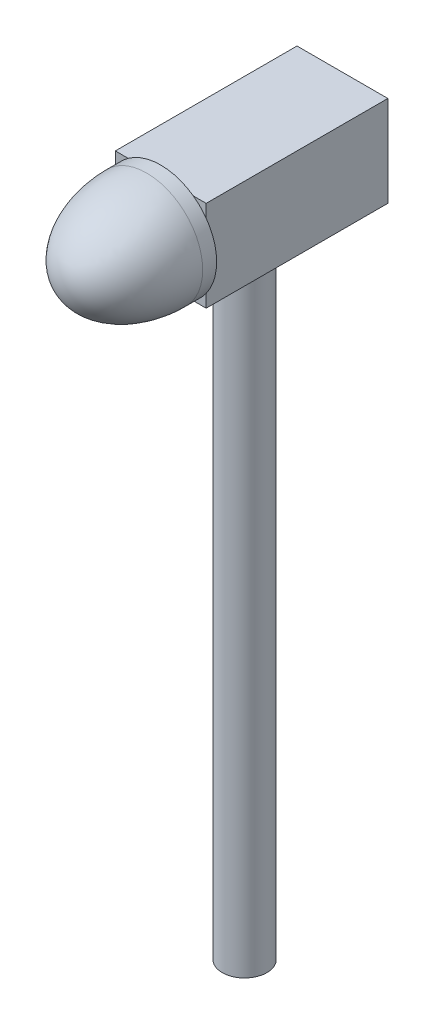
ISO-10303-21;
HEADER;
FILE_DESCRIPTION(('STEP AP214'),'2;1');
FILE_NAME('part.step','',(''),(''),'','','');
FILE_SCHEMA(('AUTOMOTIVE_DESIGN { 1 0 10303 214 1 1 1 1 }'));
ENDSEC;
DATA;
#1=APPLICATION_CONTEXT('core data for automotive mechanical design processes');
#2=APPLICATION_PROTOCOL_DEFINITION('international standard','automotive_design',2000,#1);
#3=PRODUCT_CONTEXT('',#1,'mechanical');
#4=PRODUCT('Part','Part','',(#3));
#5=PRODUCT_RELATED_PRODUCT_CATEGORY('part','',(#4));
#6=PRODUCT_DEFINITION_FORMATION('','',#4);
#7=PRODUCT_DEFINITION_CONTEXT('part definition',#1,'design');
#8=PRODUCT_DEFINITION('design','',#6,#7);
#9=PRODUCT_DEFINITION_SHAPE('','',#8);
#10=(LENGTH_UNIT() NAMED_UNIT(*) SI_UNIT(.MILLI.,.METRE.));
#11=(NAMED_UNIT(*) PLANE_ANGLE_UNIT() SI_UNIT($,.RADIAN.));
#12=(NAMED_UNIT(*) SI_UNIT($,.STERADIAN.) SOLID_ANGLE_UNIT());
#13=UNCERTAINTY_MEASURE_WITH_UNIT(LENGTH_MEASURE(1.E-05),#10,'distance_accuracy_value','');
#14=(GEOMETRIC_REPRESENTATION_CONTEXT(3) GLOBAL_UNCERTAINTY_ASSIGNED_CONTEXT((#13)) GLOBAL_UNIT_ASSIGNED_CONTEXT((#10,
#11,#12)) REPRESENTATION_CONTEXT('',''));
#15=CARTESIAN_POINT('',(0.,0.,0.));
#16=DIRECTION('',(0.,0.,1.));
#17=DIRECTION('',(1.,0.,0.));
#18=AXIS2_PLACEMENT_3D('',#15,#16,#17);
#19=CARTESIAN_POINT('',(-32.5,515.,60.));
#20=DIRECTION('',(0.,0.,-1.));
#21=DIRECTION('',(-1.,0.,0.));
#22=AXIS2_PLACEMENT_3D('',#19,#20,#21);
#23=PLANE('',#22);
#24=CARTESIAN_POINT('',(0.,482.5,60.));
#25=DIRECTION('',(0.,0.,1.));
#26=DIRECTION('',(1.,0.,0.));
#27=AXIS2_PLACEMENT_3D('',#24,#25,#26);
#28=CIRCLE('',#27,40.);
#29=CARTESIAN_POINT('',(32.5,505.818447632722,60.));
#30=VERTEX_POINT('',#29);
#31=CARTESIAN_POINT('',(23.3184476327221,515.,60.));
#32=VERTEX_POINT('',#31);
#33=EDGE_CURVE('E139',#30,#32,#28,.T.);
#34=ORIENTED_EDGE('',*,*,#33,.F.);
#35=DIRECTION('',(0.,-1.,0.));
#36=VECTOR('',#35,1.);
#37=CARTESIAN_POINT('',(32.5,515.,60.));
#38=LINE('',#37,#36);
#39=CARTESIAN_POINT('',(32.5,515.,60.));
#40=VERTEX_POINT('',#39);
#41=EDGE_CURVE('E121',#40,#30,#38,.T.);
#42=ORIENTED_EDGE('',*,*,#41,.F.);
#43=DIRECTION('',(1.,0.,0.));
#44=VECTOR('',#43,1.);
#45=CARTESIAN_POINT('',(-32.5,515.,60.));
#46=LINE('',#45,#44);
#47=EDGE_CURVE('E330',#32,#40,#46,.T.);
#48=ORIENTED_EDGE('',*,*,#47,.F.);
#49=EDGE_LOOP('',(#34,#42,#48));
#50=FACE_BOUND('',#49,.T.);
#51=ADVANCED_FACE('F45',(#50),#23,.F.);
#52=CARTESIAN_POINT('',(-23.3184476327221,515.,60.));
#53=VERTEX_POINT('',#52);
#54=CARTESIAN_POINT('',(-32.5,505.818447632722,60.));
#55=VERTEX_POINT('',#54);
#56=EDGE_CURVE('E12',#53,#55,#28,.T.);
#57=ORIENTED_EDGE('',*,*,#56,.F.);
#58=CARTESIAN_POINT('',(-32.5,515.,60.));
#59=VERTEX_POINT('',#58);
#60=EDGE_CURVE('E133',#59,#53,#46,.T.);
#61=ORIENTED_EDGE('',*,*,#60,.F.);
#62=DIRECTION('',(0.,-1.,0.));
#63=VECTOR('',#62,1.);
#64=CARTESIAN_POINT('',(-32.5,515.,60.));
#65=LINE('',#64,#63);
#66=EDGE_CURVE('E163',#59,#55,#65,.T.);
#67=ORIENTED_EDGE('',*,*,#66,.T.);
#68=EDGE_LOOP('',(#57,#61,#67));
#69=FACE_BOUND('',#68,.T.);
#70=ADVANCED_FACE('F191',(#69),#23,.F.);
#71=CARTESIAN_POINT('',(-32.5,459.181552367278,60.));
#72=VERTEX_POINT('',#71);
#73=CARTESIAN_POINT('',(-23.318447632722,450.,60.));
#74=VERTEX_POINT('',#73);
#75=EDGE_CURVE('E54',#72,#74,#28,.T.);
#76=ORIENTED_EDGE('',*,*,#75,.F.);
#77=CARTESIAN_POINT('',(-32.5,450.,60.));
#78=VERTEX_POINT('',#77);
#79=EDGE_CURVE('E164',#72,#78,#65,.T.);
#80=ORIENTED_EDGE('',*,*,#79,.T.);
#81=DIRECTION('',(1.,0.,0.));
#82=VECTOR('',#81,1.);
#83=CARTESIAN_POINT('',(-32.5,450.,60.));
#84=LINE('',#83,#82);
#85=EDGE_CURVE('E342',#78,#74,#84,.T.);
#86=ORIENTED_EDGE('',*,*,#85,.T.);
#87=EDGE_LOOP('',(#76,#80,#86));
#88=FACE_BOUND('',#87,.T.);
#89=ADVANCED_FACE('F188',(#88),#23,.F.);
#90=CARTESIAN_POINT('',(0.,450.,0.));
#91=DIRECTION('',(0.,-1.,0.));
#92=DIRECTION('',(0.,0.,-1.));
#93=AXIS2_PLACEMENT_3D('',#90,#91,#92);
#94=CYLINDRICAL_SURFACE('',#93,16.);
#95=CARTESIAN_POINT('',(0.,450.,0.));
#96=DIRECTION('',(0.,1.,0.));
#97=DIRECTION('',(0.,0.,1.));
#98=AXIS2_PLACEMENT_3D('',#95,#96,#97);
#99=CIRCLE('',#98,16.);
#100=CARTESIAN_POINT('',(0.,450.,16.));
#101=VERTEX_POINT('',#100);
#102=EDGE_CURVE('E143',#101,#101,#99,.T.);
#103=ORIENTED_EDGE('',*,*,#102,.F.);
#104=EDGE_LOOP('',(#103));
#105=FACE_BOUND('',#104,.T.);
#106=CARTESIAN_POINT('',(0.,0.,0.));
#107=DIRECTION('',(0.,1.,0.));
#108=DIRECTION('',(0.,0.,1.));
#109=AXIS2_PLACEMENT_3D('',#106,#107,#108);
#110=CIRCLE('',#109,16.);
#111=CARTESIAN_POINT('',(0.,0.,16.));
#112=VERTEX_POINT('',#111);
#113=EDGE_CURVE('E145',#112,#112,#110,.T.);
#114=ORIENTED_EDGE('',*,*,#113,.T.);
#115=EDGE_LOOP('',(#114));
#116=FACE_BOUND('',#115,.T.);
#117=ADVANCED_FACE('F177',(#105,#116),#94,.T.);
#118=CARTESIAN_POINT('',(0.,0.,0.));
#119=DIRECTION('',(0.,1.,0.));
#120=DIRECTION('',(0.,0.,1.));
#121=AXIS2_PLACEMENT_3D('',#118,#119,#120);
#122=PLANE('',#121);
#123=ORIENTED_EDGE('',*,*,#113,.F.);
#124=EDGE_LOOP('',(#123));
#125=FACE_BOUND('',#124,.T.);
#126=ADVANCED_FACE('F179',(#125),#122,.F.);
#127=CARTESIAN_POINT('',(32.5,515.,60.));
#128=DIRECTION('',(-1.,0.,0.));
#129=DIRECTION('',(0.,0.,1.));
#130=AXIS2_PLACEMENT_3D('',#127,#128,#129);
#131=PLANE('',#130);
#132=DIRECTION('',(0.,0.,-1.));
#133=VECTOR('',#132,1.);
#134=CARTESIAN_POINT('',(32.5,450.,60.));
#135=LINE('',#134,#133);
#136=CARTESIAN_POINT('',(32.5,450.,60.));
#137=VERTEX_POINT('',#136);
#138=CARTESIAN_POINT('',(32.5,450.,-70.));
#139=VERTEX_POINT('',#138);
#140=EDGE_CURVE('E151',#137,#139,#135,.T.);
#141=ORIENTED_EDGE('',*,*,#140,.T.);
#142=DIRECTION('',(0.,-1.,0.));
#143=VECTOR('',#142,1.);
#144=CARTESIAN_POINT('',(32.5,515.,-70.));
#145=LINE('',#144,#143);
#146=CARTESIAN_POINT('',(32.5,515.,-70.));
#147=VERTEX_POINT('',#146);
#148=EDGE_CURVE('E171',#147,#139,#145,.T.);
#149=ORIENTED_EDGE('',*,*,#148,.F.);
#150=DIRECTION('',(0.,0.,-1.));
#151=VECTOR('',#150,1.);
#152=CARTESIAN_POINT('',(32.5,515.,60.));
#153=LINE('',#152,#151);
#154=EDGE_CURVE('E343',#40,#147,#153,.T.);
#155=ORIENTED_EDGE('',*,*,#154,.F.);
#156=ORIENTED_EDGE('',*,*,#41,.T.);
#157=CARTESIAN_POINT('',(32.5,459.181552367278,60.));
#158=VERTEX_POINT('',#157);
#159=EDGE_CURVE('E113',#30,#158,#38,.T.);
#160=ORIENTED_EDGE('',*,*,#159,.T.);
#161=EDGE_CURVE('E117',#158,#137,#38,.T.);
#162=ORIENTED_EDGE('',*,*,#161,.T.);
#163=EDGE_LOOP('',(#141,#149,#155,#156,#160,#162));
#164=FACE_BOUND('',#163,.T.);
#165=ADVANCED_FACE('F116',(#164),#131,.F.);
#166=CARTESIAN_POINT('',(-32.5,515.,-70.));
#167=DIRECTION('',(0.,0.,1.));
#168=DIRECTION('',(1.,0.,0.));
#169=AXIS2_PLACEMENT_3D('',#166,#167,#168);
#170=PLANE('',#169);
#171=DIRECTION('',(-1.,0.,0.));
#172=VECTOR('',#171,1.);
#173=CARTESIAN_POINT('',(-32.5,450.,-70.));
#174=LINE('',#173,#172);
#175=CARTESIAN_POINT('',(-32.5,450.,-70.));
#176=VERTEX_POINT('',#175);
#177=EDGE_CURVE('E338',#139,#176,#174,.T.);
#178=ORIENTED_EDGE('',*,*,#177,.T.);
#179=DIRECTION('',(0.,-1.,0.));
#180=VECTOR('',#179,1.);
#181=CARTESIAN_POINT('',(-32.5,515.,-70.));
#182=LINE('',#181,#180);
#183=CARTESIAN_POINT('',(-32.5,515.,-70.));
#184=VERTEX_POINT('',#183);
#185=EDGE_CURVE('E166',#184,#176,#182,.T.);
#186=ORIENTED_EDGE('',*,*,#185,.F.);
#187=DIRECTION('',(-1.,0.,0.));
#188=VECTOR('',#187,1.);
#189=CARTESIAN_POINT('',(-32.5,515.,-70.));
#190=LINE('',#189,#188);
#191=EDGE_CURVE('E348',#147,#184,#190,.T.);
#192=ORIENTED_EDGE('',*,*,#191,.F.);
#193=ORIENTED_EDGE('',*,*,#148,.T.);
#194=EDGE_LOOP('',(#178,#186,#192,#193));
#195=FACE_BOUND('',#194,.T.);
#196=ADVANCED_FACE('F186',(#195),#170,.F.);
#197=CARTESIAN_POINT('',(-32.5,515.,60.));
#198=DIRECTION('',(1.,0.,0.));
#199=DIRECTION('',(0.,0.,-1.));
#200=AXIS2_PLACEMENT_3D('',#197,#198,#199);
#201=PLANE('',#200);
#202=DIRECTION('',(0.,0.,1.));
#203=VECTOR('',#202,1.);
#204=CARTESIAN_POINT('',(-32.5,450.,60.));
#205=LINE('',#204,#203);
#206=EDGE_CURVE('E340',#176,#78,#205,.T.);
#207=ORIENTED_EDGE('',*,*,#206,.T.);
#208=ORIENTED_EDGE('',*,*,#79,.F.);
#209=EDGE_CURVE('E159',#55,#72,#65,.T.);
#210=ORIENTED_EDGE('',*,*,#209,.F.);
#211=ORIENTED_EDGE('',*,*,#66,.F.);
#212=DIRECTION('',(0.,0.,1.));
#213=VECTOR('',#212,1.);
#214=CARTESIAN_POINT('',(-32.5,515.,60.));
#215=LINE('',#214,#213);
#216=EDGE_CURVE('E332',#184,#59,#215,.T.);
#217=ORIENTED_EDGE('',*,*,#216,.F.);
#218=ORIENTED_EDGE('',*,*,#185,.T.);
#219=EDGE_LOOP('',(#207,#208,#210,#211,#217,#218));
#220=FACE_BOUND('',#219,.T.);
#221=ADVANCED_FACE('F202',(#220),#201,.F.);
#222=CARTESIAN_POINT('',(23.318447632722,450.,60.));
#223=VERTEX_POINT('',#222);
#224=EDGE_CURVE('E129',#223,#158,#28,.T.);
#225=ORIENTED_EDGE('',*,*,#224,.F.);
#226=EDGE_CURVE('E131',#223,#137,#84,.T.);
#227=ORIENTED_EDGE('',*,*,#226,.T.);
#228=ORIENTED_EDGE('',*,*,#161,.F.);
#229=EDGE_LOOP('',(#225,#227,#228));
#230=FACE_BOUND('',#229,.T.);
#231=ADVANCED_FACE('F127',(#230),#23,.F.);
#232=CARTESIAN_POINT('',(0.,515.,0.));
#233=DIRECTION('',(0.,-1.,0.));
#234=DIRECTION('',(0.,0.,-1.));
#235=AXIS2_PLACEMENT_3D('',#232,#233,#234);
#236=PLANE('',#235);
#237=ORIENTED_EDGE('',*,*,#154,.T.);
#238=ORIENTED_EDGE('',*,*,#191,.T.);
#239=ORIENTED_EDGE('',*,*,#216,.T.);
#240=ORIENTED_EDGE('',*,*,#60,.T.);
#241=EDGE_CURVE('E328',#53,#32,#46,.T.);
#242=ORIENTED_EDGE('',*,*,#241,.T.);
#243=ORIENTED_EDGE('',*,*,#47,.T.);
#244=EDGE_LOOP('',(#237,#238,#239,#240,#242,#243));
#245=FACE_BOUND('',#244,.T.);
#246=ADVANCED_FACE('F201',(#245),#236,.F.);
#247=CARTESIAN_POINT('',(0.,450.,0.));
#248=DIRECTION('',(0.,-1.,0.));
#249=DIRECTION('',(0.,0.,-1.));
#250=AXIS2_PLACEMENT_3D('',#247,#248,#249);
#251=PLANE('',#250);
#252=ORIENTED_EDGE('',*,*,#102,.T.);
#253=EDGE_LOOP('',(#252));
#254=FACE_BOUND('',#253,.T.);
#255=ORIENTED_EDGE('',*,*,#140,.F.);
#256=ORIENTED_EDGE('',*,*,#226,.F.);
#257=EDGE_CURVE('E344',#74,#223,#84,.T.);
#258=ORIENTED_EDGE('',*,*,#257,.F.);
#259=ORIENTED_EDGE('',*,*,#85,.F.);
#260=ORIENTED_EDGE('',*,*,#206,.F.);
#261=ORIENTED_EDGE('',*,*,#177,.F.);
#262=EDGE_LOOP('',(#255,#256,#258,#259,#260,#261));
#263=FACE_BOUND('',#262,.T.);
#264=ADVANCED_FACE('F207',(#254,#263),#251,.T.);
#265=CARTESIAN_POINT('',(0.,482.5,60.));
#266=DIRECTION('',(0.,0.,1.));
#267=DIRECTION('',(1.,0.,0.));
#268=AXIS2_PLACEMENT_3D('',#265,#266,#267);
#269=PLANE('',#268);
#270=EDGE_CURVE('E138',#74,#223,#28,.T.);
#271=ORIENTED_EDGE('',*,*,#270,.F.);
#272=ORIENTED_EDGE('',*,*,#257,.T.);
#273=EDGE_LOOP('',(#271,#272));
#274=FACE_BOUND('',#273,.T.);
#275=ADVANCED_FACE('F256',(#274),#269,.F.);
#276=ORIENTED_EDGE('',*,*,#159,.F.);
#277=EDGE_CURVE('E134',#158,#30,#28,.T.);
#278=ORIENTED_EDGE('',*,*,#277,.F.);
#279=EDGE_LOOP('',(#276,#278));
#280=FACE_BOUND('',#279,.T.);
#281=ADVANCED_FACE('F135',(#280),#269,.F.);
#282=EDGE_CURVE('E152',#55,#72,#28,.T.);
#283=ORIENTED_EDGE('',*,*,#282,.F.);
#284=ORIENTED_EDGE('',*,*,#209,.T.);
#285=EDGE_LOOP('',(#283,#284));
#286=FACE_BOUND('',#285,.T.);
#287=ADVANCED_FACE('F158',(#286),#269,.F.);
#288=CARTESIAN_POINT('',(0.,482.5,70.));
#289=DIRECTION('',(0.,0.,-1.));
#290=DIRECTION('',(-1.,0.,0.));
#291=AXIS2_PLACEMENT_3D('',#288,#289,#290);
#292=CYLINDRICAL_SURFACE('',#291,40.);
#293=CARTESIAN_POINT('',(0.,482.5,70.));
#294=DIRECTION('',(0.,0.,1.));
#295=DIRECTION('',(1.,0.,0.));
#296=AXIS2_PLACEMENT_3D('',#293,#294,#295);
#297=CIRCLE('',#296,40.);
#298=CARTESIAN_POINT('',(40.,482.5,70.));
#299=VERTEX_POINT('',#298);
#300=EDGE_CURVE('E148',#299,#299,#297,.T.);
#301=ORIENTED_EDGE('',*,*,#300,.F.);
#302=EDGE_LOOP('',(#301));
#303=FACE_BOUND('',#302,.T.);
#304=ORIENTED_EDGE('',*,*,#33,.T.);
#305=EDGE_CURVE('E56',#32,#53,#28,.T.);
#306=ORIENTED_EDGE('',*,*,#305,.T.);
#307=ORIENTED_EDGE('',*,*,#56,.T.);
#308=ORIENTED_EDGE('',*,*,#282,.T.);
#309=ORIENTED_EDGE('',*,*,#75,.T.);
#310=ORIENTED_EDGE('',*,*,#270,.T.);
#311=ORIENTED_EDGE('',*,*,#224,.T.);
#312=ORIENTED_EDGE('',*,*,#277,.T.);
#313=EDGE_LOOP('',(#304,#306,#307,#308,#309,#310,#311,#312));
#314=FACE_BOUND('',#313,.T.);
#315=ADVANCED_FACE('F141',(#303,#314),#292,.T.);
#316=CARTESIAN_POINT('',(0.,482.5,70.));
#317=DIRECTION('',(0.,1.,0.));
#318=DIRECTION('',(0.,0.,1.));
#319=AXIS2_PLACEMENT_3D('',#316,#317,#318);
#320=ELLIPSE('',#319,60.,40.);
#321=TRIMMED_CURVE('',#320,(PARAMETER_VALUE(0.)),(PARAMETER_VALUE(3.14159265358979)),.T.,.PARAMETER.);
#322=CARTESIAN_POINT('',(0.,482.5,9.99999999999998));
#323=DIRECTION('',(0.,0.,1.));
#324=AXIS1_PLACEMENT('',#322,#323);
#325=SURFACE_OF_REVOLUTION('',#321,#324);
#326=CARTESIAN_POINT('',(0.,482.5,130.));
#327=VERTEX_POINT('',#326);
#328=VERTEX_LOOP('',#327);
#329=FACE_BOUND('',#328,.T.);
#330=ORIENTED_EDGE('',*,*,#300,.T.);
#331=EDGE_LOOP('',(#330));
#332=FACE_BOUND('',#331,.T.);
#333=ADVANCED_FACE('F47',(#329,#332),#325,.F.);
#334=ORIENTED_EDGE('',*,*,#241,.F.);
#335=ORIENTED_EDGE('',*,*,#305,.F.);
#336=EDGE_LOOP('',(#334,#335));
#337=FACE_BOUND('',#336,.T.);
#338=ADVANCED_FACE('F284',(#337),#269,.F.);
#339=CLOSED_SHELL('',(#51,#70,#89,#117,#126,#165,#196,#221,#231,#246,#264,#275,#281,#287,#315,
#333,#338));
#340=MANIFOLD_SOLID_BREP('B2',#339);
#341=ADVANCED_BREP_SHAPE_REPRESENTATION('',(#18,#340),#14);
#342=SHAPE_DEFINITION_REPRESENTATION(#9,#341);
ENDSEC;
END-ISO-10303-21;
